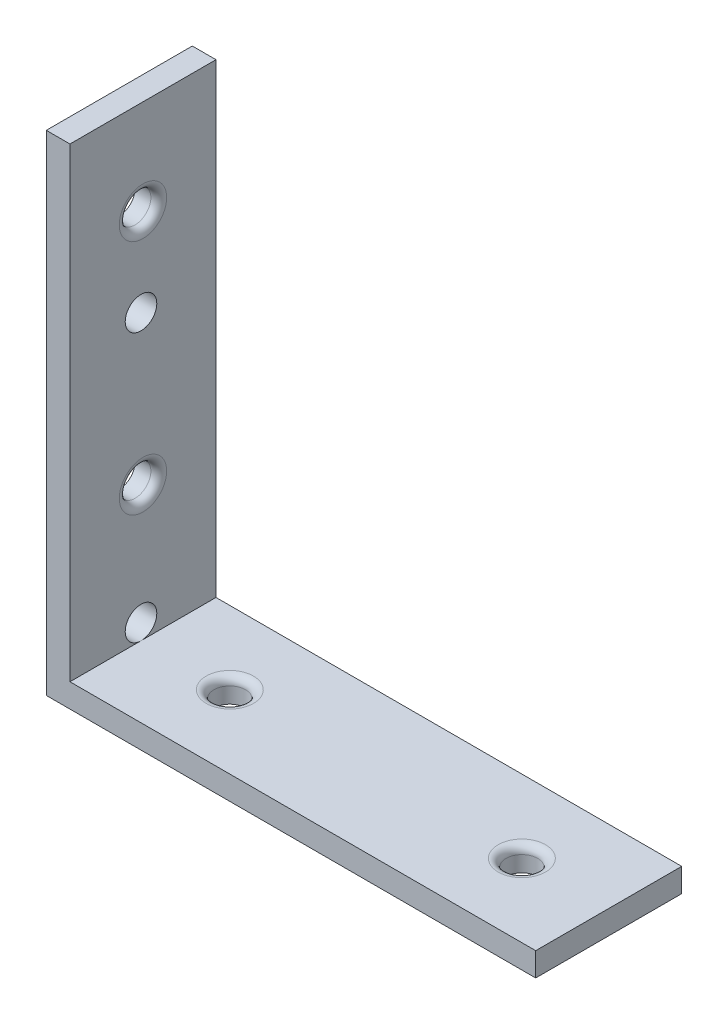
ISO-10303-21;
HEADER;
FILE_DESCRIPTION(('STEP AP214'),'2;1');
FILE_NAME('part.step','',(''),(''),'','','');
FILE_SCHEMA(('AUTOMOTIVE_DESIGN { 1 0 10303 214 1 1 1 1 }'));
ENDSEC;
DATA;
#1=APPLICATION_CONTEXT('core data for automotive mechanical design processes');
#2=APPLICATION_PROTOCOL_DEFINITION('international standard','automotive_design',2000,#1);
#3=PRODUCT_CONTEXT('',#1,'mechanical');
#4=PRODUCT('Part','Part','',(#3));
#5=PRODUCT_RELATED_PRODUCT_CATEGORY('part','',(#4));
#6=PRODUCT_DEFINITION_FORMATION('','',#4);
#7=PRODUCT_DEFINITION_CONTEXT('part definition',#1,'design');
#8=PRODUCT_DEFINITION('design','',#6,#7);
#9=PRODUCT_DEFINITION_SHAPE('','',#8);
#10=(LENGTH_UNIT() NAMED_UNIT(*) SI_UNIT(.MILLI.,.METRE.));
#11=(NAMED_UNIT(*) PLANE_ANGLE_UNIT() SI_UNIT($,.RADIAN.));
#12=(NAMED_UNIT(*) SI_UNIT($,.STERADIAN.) SOLID_ANGLE_UNIT());
#13=UNCERTAINTY_MEASURE_WITH_UNIT(LENGTH_MEASURE(1.E-05),#10,'distance_accuracy_value','');
#14=(GEOMETRIC_REPRESENTATION_CONTEXT(3) GLOBAL_UNCERTAINTY_ASSIGNED_CONTEXT((#13)) GLOBAL_UNIT_ASSIGNED_CONTEXT((#10,
#11,#12)) REPRESENTATION_CONTEXT('',''));
#15=CARTESIAN_POINT('',(0.,0.,0.));
#16=DIRECTION('',(0.,0.,1.));
#17=DIRECTION('',(1.,0.,0.));
#18=AXIS2_PLACEMENT_3D('',#15,#16,#17);
#19=CARTESIAN_POINT('',(31.,31.,18.5));
#20=DIRECTION('',(-1.,0.,0.));
#21=DIRECTION('',(0.,0.,1.));
#22=AXIS2_PLACEMENT_3D('',#19,#20,#21);
#23=PLANE('',#22);
#24=DIRECTION('',(0.,1.,0.));
#25=VECTOR('',#24,1.);
#26=CARTESIAN_POINT('',(31.,31.,0.));
#27=LINE('',#26,#25);
#28=CARTESIAN_POINT('',(31.,-31.,0.));
#29=VERTEX_POINT('',#28);
#30=CARTESIAN_POINT('',(31.,-28.,0.));
#31=VERTEX_POINT('',#30);
#32=EDGE_CURVE('E134',#29,#31,#27,.T.);
#33=ORIENTED_EDGE('',*,*,#32,.T.);
#34=DIRECTION('',(0.,0.,1.));
#35=VECTOR('',#34,1.);
#36=CARTESIAN_POINT('',(31.,-28.,0.));
#37=LINE('',#36,#35);
#38=CARTESIAN_POINT('',(31.,-28.,18.5));
#39=VERTEX_POINT('',#38);
#40=EDGE_CURVE('E141',#31,#39,#37,.T.);
#41=ORIENTED_EDGE('',*,*,#40,.T.);
#42=DIRECTION('',(0.,1.,0.));
#43=VECTOR('',#42,1.);
#44=CARTESIAN_POINT('',(31.,31.,18.5));
#45=LINE('',#44,#43);
#46=CARTESIAN_POINT('',(31.,-31.,18.5));
#47=VERTEX_POINT('',#46);
#48=EDGE_CURVE('E147',#47,#39,#45,.T.);
#49=ORIENTED_EDGE('',*,*,#48,.F.);
#50=DIRECTION('',(0.,0.,-1.));
#51=VECTOR('',#50,1.);
#52=CARTESIAN_POINT('',(31.,-31.,18.5));
#53=LINE('',#52,#51);
#54=EDGE_CURVE('E148',#47,#29,#53,.T.);
#55=ORIENTED_EDGE('',*,*,#54,.T.);
#56=EDGE_LOOP('',(#33,#41,#49,#55));
#57=FACE_BOUND('',#56,.T.);
#58=ADVANCED_FACE('F50',(#57),#23,.F.);
#59=CARTESIAN_POINT('',(-31.,31.,18.5));
#60=DIRECTION('',(0.,-1.,0.));
#61=DIRECTION('',(0.,0.,-1.));
#62=AXIS2_PLACEMENT_3D('',#59,#60,#61);
#63=PLANE('',#62);
#64=DIRECTION('',(-1.,0.,0.));
#65=VECTOR('',#64,1.);
#66=CARTESIAN_POINT('',(-31.,31.,18.5));
#67=LINE('',#66,#65);
#68=CARTESIAN_POINT('',(-28.,31.,18.5));
#69=VERTEX_POINT('',#68);
#70=CARTESIAN_POINT('',(-31.,31.,18.5));
#71=VERTEX_POINT('',#70);
#72=EDGE_CURVE('E125',#69,#71,#67,.T.);
#73=ORIENTED_EDGE('',*,*,#72,.F.);
#74=DIRECTION('',(0.,0.,1.));
#75=VECTOR('',#74,1.);
#76=CARTESIAN_POINT('',(-28.,31.,0.));
#77=LINE('',#76,#75);
#78=CARTESIAN_POINT('',(-28.,31.,0.));
#79=VERTEX_POINT('',#78);
#80=EDGE_CURVE('E111',#79,#69,#77,.T.);
#81=ORIENTED_EDGE('',*,*,#80,.F.);
#82=DIRECTION('',(-1.,0.,0.));
#83=VECTOR('',#82,1.);
#84=CARTESIAN_POINT('',(-31.,31.,0.));
#85=LINE('',#84,#83);
#86=CARTESIAN_POINT('',(-31.,31.,0.));
#87=VERTEX_POINT('',#86);
#88=EDGE_CURVE('E123',#79,#87,#85,.T.);
#89=ORIENTED_EDGE('',*,*,#88,.T.);
#90=DIRECTION('',(0.,0.,-1.));
#91=VECTOR('',#90,1.);
#92=CARTESIAN_POINT('',(-31.,31.,18.5));
#93=LINE('',#92,#91);
#94=EDGE_CURVE('E157',#71,#87,#93,.T.);
#95=ORIENTED_EDGE('',*,*,#94,.F.);
#96=EDGE_LOOP('',(#73,#81,#89,#95));
#97=FACE_BOUND('',#96,.T.);
#98=ADVANCED_FACE('F121',(#97),#63,.F.);
#99=CARTESIAN_POINT('',(-31.,31.,18.5));
#100=DIRECTION('',(1.,0.,0.));
#101=DIRECTION('',(0.,0.,-1.));
#102=AXIS2_PLACEMENT_3D('',#99,#100,#101);
#103=PLANE('',#102);
#104=CARTESIAN_POINT('',(-31.,8.,9.5));
#105=DIRECTION('',(1.,0.,0.));
#106=DIRECTION('',(0.,1.,0.));
#107=AXIS2_PLACEMENT_3D('',#104,#105,#106);
#108=CIRCLE('',#107,2.);
#109=CARTESIAN_POINT('',(-31.,10.,9.5));
#110=VERTEX_POINT('',#109);
#111=EDGE_CURVE('E282',#110,#110,#108,.T.);
#112=ORIENTED_EDGE('',*,*,#111,.T.);
#113=EDGE_LOOP('',(#112));
#114=FACE_BOUND('',#113,.T.);
#115=CARTESIAN_POINT('',(-31.,-26.,9.5));
#116=DIRECTION('',(1.,0.,0.));
#117=DIRECTION('',(0.,1.,0.));
#118=AXIS2_PLACEMENT_3D('',#115,#116,#117);
#119=CIRCLE('',#118,2.);
#120=CARTESIAN_POINT('',(-31.,-24.,9.5));
#121=VERTEX_POINT('',#120);
#122=EDGE_CURVE('E281',#121,#121,#119,.T.);
#123=ORIENTED_EDGE('',*,*,#122,.T.);
#124=EDGE_LOOP('',(#123));
#125=FACE_BOUND('',#124,.T.);
#126=CARTESIAN_POINT('',(-31.,19.,9.25));
#127=DIRECTION('',(1.,0.,0.));
#128=DIRECTION('',(0.,1.,0.));
#129=AXIS2_PLACEMENT_3D('',#126,#127,#128);
#130=CIRCLE('',#129,2.);
#131=CARTESIAN_POINT('',(-31.,21.,9.25));
#132=VERTEX_POINT('',#131);
#133=EDGE_CURVE('E287',#132,#132,#130,.T.);
#134=ORIENTED_EDGE('',*,*,#133,.T.);
#135=EDGE_LOOP('',(#134));
#136=FACE_BOUND('',#135,.T.);
#137=CARTESIAN_POINT('',(-31.,-11.,9.25));
#138=DIRECTION('',(1.,0.,0.));
#139=DIRECTION('',(0.,1.,0.));
#140=AXIS2_PLACEMENT_3D('',#137,#138,#139);
#141=CIRCLE('',#140,2.);
#142=CARTESIAN_POINT('',(-31.,-9.,9.25));
#143=VERTEX_POINT('',#142);
#144=EDGE_CURVE('E246',#143,#143,#141,.T.);
#145=ORIENTED_EDGE('',*,*,#144,.T.);
#146=EDGE_LOOP('',(#145));
#147=FACE_BOUND('',#146,.T.);
#148=DIRECTION('',(0.,-1.,0.));
#149=VECTOR('',#148,1.);
#150=CARTESIAN_POINT('',(-31.,31.,0.));
#151=LINE('',#150,#149);
#152=CARTESIAN_POINT('',(-31.,-31.,0.));
#153=VERTEX_POINT('',#152);
#154=EDGE_CURVE('E132',#87,#153,#151,.T.);
#155=ORIENTED_EDGE('',*,*,#154,.T.);
#156=DIRECTION('',(0.,0.,-1.));
#157=VECTOR('',#156,1.);
#158=CARTESIAN_POINT('',(-31.,-31.,18.5));
#159=LINE('',#158,#157);
#160=CARTESIAN_POINT('',(-31.,-31.,18.5));
#161=VERTEX_POINT('',#160);
#162=EDGE_CURVE('E152',#161,#153,#159,.T.);
#163=ORIENTED_EDGE('',*,*,#162,.F.);
#164=DIRECTION('',(0.,-1.,0.));
#165=VECTOR('',#164,1.);
#166=CARTESIAN_POINT('',(-31.,31.,18.5));
#167=LINE('',#166,#165);
#168=EDGE_CURVE('E264',#71,#161,#167,.T.);
#169=ORIENTED_EDGE('',*,*,#168,.F.);
#170=ORIENTED_EDGE('',*,*,#94,.T.);
#171=EDGE_LOOP('',(#155,#163,#169,#170));
#172=FACE_BOUND('',#171,.T.);
#173=ADVANCED_FACE('F210',(#114,#125,#136,#147,#172),#103,.F.);
#174=CARTESIAN_POINT('',(-31.,-31.,18.5));
#175=DIRECTION('',(0.,1.,0.));
#176=DIRECTION('',(0.,0.,1.));
#177=AXIS2_PLACEMENT_3D('',#174,#175,#176);
#178=PLANE('',#177);
#179=CARTESIAN_POINT('',(20.,-31.,9.25));
#180=DIRECTION('',(0.,1.,0.));
#181=DIRECTION('',(-1.,0.,0.));
#182=AXIS2_PLACEMENT_3D('',#179,#180,#181);
#183=CIRCLE('',#182,2.);
#184=CARTESIAN_POINT('',(18.,-31.,9.25));
#185=VERTEX_POINT('',#184);
#186=EDGE_CURVE('E240',#185,#185,#183,.T.);
#187=ORIENTED_EDGE('',*,*,#186,.T.);
#188=EDGE_LOOP('',(#187));
#189=FACE_BOUND('',#188,.T.);
#190=CARTESIAN_POINT('',(-17.,-31.,9.25));
#191=DIRECTION('',(0.,1.,0.));
#192=DIRECTION('',(-1.,0.,0.));
#193=AXIS2_PLACEMENT_3D('',#190,#191,#192);
#194=CIRCLE('',#193,2.);
#195=CARTESIAN_POINT('',(-19.,-31.,9.25));
#196=VERTEX_POINT('',#195);
#197=EDGE_CURVE('E236',#196,#196,#194,.T.);
#198=ORIENTED_EDGE('',*,*,#197,.T.);
#199=EDGE_LOOP('',(#198));
#200=FACE_BOUND('',#199,.T.);
#201=DIRECTION('',(1.,0.,0.));
#202=VECTOR('',#201,1.);
#203=CARTESIAN_POINT('',(-31.,-31.,0.));
#204=LINE('',#203,#202);
#205=EDGE_CURVE('E138',#153,#29,#204,.T.);
#206=ORIENTED_EDGE('',*,*,#205,.T.);
#207=ORIENTED_EDGE('',*,*,#54,.F.);
#208=DIRECTION('',(1.,0.,0.));
#209=VECTOR('',#208,1.);
#210=CARTESIAN_POINT('',(-31.,-31.,18.5));
#211=LINE('',#210,#209);
#212=EDGE_CURVE('E153',#161,#47,#211,.T.);
#213=ORIENTED_EDGE('',*,*,#212,.F.);
#214=ORIENTED_EDGE('',*,*,#162,.T.);
#215=EDGE_LOOP('',(#206,#207,#213,#214));
#216=FACE_BOUND('',#215,.T.);
#217=ADVANCED_FACE('F276',(#189,#200,#216),#178,.F.);
#218=CARTESIAN_POINT('',(0.,0.,18.5));
#219=DIRECTION('',(0.,0.,1.));
#220=DIRECTION('',(1.,0.,0.));
#221=AXIS2_PLACEMENT_3D('',#218,#219,#220);
#222=PLANE('',#221);
#223=DIRECTION('',(1.,0.,0.));
#224=VECTOR('',#223,1.);
#225=CARTESIAN_POINT('',(31.,-28.,18.5));
#226=LINE('',#225,#224);
#227=CARTESIAN_POINT('',(-28.,-28.,18.5));
#228=VERTEX_POINT('',#227);
#229=EDGE_CURVE('E117',#228,#39,#226,.T.);
#230=ORIENTED_EDGE('',*,*,#229,.F.);
#231=DIRECTION('',(0.,-1.,0.));
#232=VECTOR('',#231,1.);
#233=CARTESIAN_POINT('',(-28.,31.,18.5));
#234=LINE('',#233,#232);
#235=EDGE_CURVE('E239',#69,#228,#234,.T.);
#236=ORIENTED_EDGE('',*,*,#235,.F.);
#237=ORIENTED_EDGE('',*,*,#72,.T.);
#238=ORIENTED_EDGE('',*,*,#168,.T.);
#239=ORIENTED_EDGE('',*,*,#212,.T.);
#240=ORIENTED_EDGE('',*,*,#48,.T.);
#241=EDGE_LOOP('',(#230,#236,#237,#238,#239,#240));
#242=FACE_BOUND('',#241,.T.);
#243=ADVANCED_FACE('F271',(#242),#222,.T.);
#244=CARTESIAN_POINT('',(0.,0.,0.));
#245=DIRECTION('',(0.,0.,1.));
#246=DIRECTION('',(1.,0.,0.));
#247=AXIS2_PLACEMENT_3D('',#244,#245,#246);
#248=PLANE('',#247);
#249=DIRECTION('',(0.,-1.,0.));
#250=VECTOR('',#249,1.);
#251=CARTESIAN_POINT('',(-28.,31.,0.));
#252=LINE('',#251,#250);
#253=CARTESIAN_POINT('',(-28.,-28.,0.));
#254=VERTEX_POINT('',#253);
#255=EDGE_CURVE('E106',#79,#254,#252,.T.);
#256=ORIENTED_EDGE('',*,*,#255,.T.);
#257=DIRECTION('',(1.,0.,0.));
#258=VECTOR('',#257,1.);
#259=CARTESIAN_POINT('',(31.,-28.,0.));
#260=LINE('',#259,#258);
#261=EDGE_CURVE('E71',#254,#31,#260,.T.);
#262=ORIENTED_EDGE('',*,*,#261,.T.);
#263=ORIENTED_EDGE('',*,*,#32,.F.);
#264=ORIENTED_EDGE('',*,*,#205,.F.);
#265=ORIENTED_EDGE('',*,*,#154,.F.);
#266=ORIENTED_EDGE('',*,*,#88,.F.);
#267=EDGE_LOOP('',(#256,#262,#263,#264,#265,#266));
#268=FACE_BOUND('',#267,.T.);
#269=ADVANCED_FACE('F130',(#268),#248,.F.);
#270=CARTESIAN_POINT('',(31.,-28.,0.));
#271=DIRECTION('',(0.,-1.,0.));
#272=DIRECTION('',(1.,0.,0.));
#273=AXIS2_PLACEMENT_3D('',#270,#271,#272);
#274=PLANE('',#273);
#275=CARTESIAN_POINT('',(-17.,-28.,9.25));
#276=DIRECTION('',(0.,-1.,0.));
#277=DIRECTION('',(1.,0.,0.));
#278=AXIS2_PLACEMENT_3D('',#275,#276,#277);
#279=CIRCLE('',#278,3.);
#280=CARTESIAN_POINT('',(-14.,-28.,9.25));
#281=VERTEX_POINT('',#280);
#282=EDGE_CURVE('E172',#281,#281,#279,.T.);
#283=ORIENTED_EDGE('',*,*,#282,.T.);
#284=EDGE_LOOP('',(#283));
#285=FACE_BOUND('',#284,.T.);
#286=CARTESIAN_POINT('',(20.,-28.,9.25));
#287=DIRECTION('',(0.,-1.,0.));
#288=DIRECTION('',(1.,0.,0.));
#289=AXIS2_PLACEMENT_3D('',#286,#287,#288);
#290=CIRCLE('',#289,3.);
#291=CARTESIAN_POINT('',(23.,-28.,9.25));
#292=VERTEX_POINT('',#291);
#293=EDGE_CURVE('E164',#292,#292,#290,.T.);
#294=ORIENTED_EDGE('',*,*,#293,.T.);
#295=EDGE_LOOP('',(#294));
#296=FACE_BOUND('',#295,.T.);
#297=ORIENTED_EDGE('',*,*,#229,.T.);
#298=ORIENTED_EDGE('',*,*,#40,.F.);
#299=ORIENTED_EDGE('',*,*,#261,.F.);
#300=DIRECTION('',(0.,0.,1.));
#301=VECTOR('',#300,1.);
#302=CARTESIAN_POINT('',(-28.,-28.,0.));
#303=LINE('',#302,#301);
#304=CARTESIAN_POINT('',(-28.,-28.,9.5));
#305=VERTEX_POINT('',#304);
#306=EDGE_CURVE('E113',#254,#305,#303,.T.);
#307=ORIENTED_EDGE('',*,*,#306,.T.);
#308=EDGE_CURVE('E127',#305,#228,#303,.T.);
#309=ORIENTED_EDGE('',*,*,#308,.T.);
#310=EDGE_LOOP('',(#297,#298,#299,#307,#309));
#311=FACE_BOUND('',#310,.T.);
#312=ADVANCED_FACE('F278',(#285,#296,#311),#274,.F.);
#313=CARTESIAN_POINT('',(-28.,31.,0.));
#314=DIRECTION('',(-1.,0.,0.));
#315=DIRECTION('',(0.,-1.,0.));
#316=AXIS2_PLACEMENT_3D('',#313,#314,#315);
#317=PLANE('',#316);
#318=CARTESIAN_POINT('',(-28.,8.,9.5));
#319=DIRECTION('',(1.,0.,0.));
#320=DIRECTION('',(0.,1.,0.));
#321=AXIS2_PLACEMENT_3D('',#318,#319,#320);
#322=CIRCLE('',#321,2.);
#323=CARTESIAN_POINT('',(-28.,10.,9.5));
#324=VERTEX_POINT('',#323);
#325=EDGE_CURVE('E290',#324,#324,#322,.T.);
#326=ORIENTED_EDGE('',*,*,#325,.F.);
#327=EDGE_LOOP('',(#326));
#328=FACE_BOUND('',#327,.T.);
#329=CARTESIAN_POINT('',(-28.,-11.,9.25));
#330=DIRECTION('',(-1.,0.,0.));
#331=DIRECTION('',(0.,-1.,0.));
#332=AXIS2_PLACEMENT_3D('',#329,#330,#331);
#333=CIRCLE('',#332,3.);
#334=CARTESIAN_POINT('',(-28.,-14.,9.25));
#335=VERTEX_POINT('',#334);
#336=EDGE_CURVE('E13',#335,#335,#333,.T.);
#337=ORIENTED_EDGE('',*,*,#336,.T.);
#338=EDGE_LOOP('',(#337));
#339=FACE_BOUND('',#338,.T.);
#340=CARTESIAN_POINT('',(-28.,19.,9.25));
#341=DIRECTION('',(-1.,0.,0.));
#342=DIRECTION('',(0.,-1.,0.));
#343=AXIS2_PLACEMENT_3D('',#340,#341,#342);
#344=CIRCLE('',#343,3.);
#345=CARTESIAN_POINT('',(-28.,16.,9.25));
#346=VERTEX_POINT('',#345);
#347=EDGE_CURVE('E180',#346,#346,#344,.T.);
#348=ORIENTED_EDGE('',*,*,#347,.T.);
#349=EDGE_LOOP('',(#348));
#350=FACE_BOUND('',#349,.T.);
#351=ORIENTED_EDGE('',*,*,#308,.F.);
#352=CARTESIAN_POINT('',(-28.,-26.,9.5));
#353=DIRECTION('',(1.,0.,0.));
#354=DIRECTION('',(0.,1.,0.));
#355=AXIS2_PLACEMENT_3D('',#352,#353,#354);
#356=CIRCLE('',#355,2.);
#357=EDGE_CURVE('E64',#305,#305,#356,.T.);
#358=ORIENTED_EDGE('',*,*,#357,.F.);
#359=ORIENTED_EDGE('',*,*,#306,.F.);
#360=ORIENTED_EDGE('',*,*,#255,.F.);
#361=ORIENTED_EDGE('',*,*,#80,.T.);
#362=ORIENTED_EDGE('',*,*,#235,.T.);
#363=EDGE_LOOP('',(#351,#358,#359,#360,#361,#362));
#364=FACE_BOUND('',#363,.T.);
#365=ADVANCED_FACE('F109',(#328,#339,#350,#364),#317,.F.);
#366=CARTESIAN_POINT('',(-17.,-31.,9.25));
#367=DIRECTION('',(0.,1.,0.));
#368=DIRECTION('',(-1.,0.,0.));
#369=AXIS2_PLACEMENT_3D('',#366,#367,#368);
#370=CYLINDRICAL_SURFACE('',#369,2.);
#371=CARTESIAN_POINT('',(-17.,-29.,9.25));
#372=DIRECTION('',(0.,-1.,0.));
#373=DIRECTION('',(1.,0.,0.));
#374=AXIS2_PLACEMENT_3D('',#371,#372,#373);
#375=CIRCLE('',#374,2.);
#376=CARTESIAN_POINT('',(-15.,-29.,9.25));
#377=VERTEX_POINT('',#376);
#378=EDGE_CURVE('E168',#377,#377,#375,.F.);
#379=ORIENTED_EDGE('',*,*,#378,.T.);
#380=EDGE_LOOP('',(#379));
#381=FACE_BOUND('',#380,.T.);
#382=ORIENTED_EDGE('',*,*,#197,.F.);
#383=EDGE_LOOP('',(#382));
#384=FACE_BOUND('',#383,.T.);
#385=ADVANCED_FACE('F230',(#381,#384),#370,.F.);
#386=CARTESIAN_POINT('',(20.,-31.,9.25));
#387=DIRECTION('',(0.,1.,0.));
#388=DIRECTION('',(-1.,0.,0.));
#389=AXIS2_PLACEMENT_3D('',#386,#387,#388);
#390=CYLINDRICAL_SURFACE('',#389,2.);
#391=CARTESIAN_POINT('',(20.,-29.,9.25));
#392=DIRECTION('',(0.,-1.,0.));
#393=DIRECTION('',(1.,0.,0.));
#394=AXIS2_PLACEMENT_3D('',#391,#392,#393);
#395=CIRCLE('',#394,2.);
#396=CARTESIAN_POINT('',(22.,-29.,9.25));
#397=VERTEX_POINT('',#396);
#398=EDGE_CURVE('E160',#397,#397,#395,.F.);
#399=ORIENTED_EDGE('',*,*,#398,.T.);
#400=EDGE_LOOP('',(#399));
#401=FACE_BOUND('',#400,.T.);
#402=ORIENTED_EDGE('',*,*,#186,.F.);
#403=EDGE_LOOP('',(#402));
#404=FACE_BOUND('',#403,.T.);
#405=ADVANCED_FACE('F218',(#401,#404),#390,.F.);
#406=CARTESIAN_POINT('',(20.,-29.,9.25));
#407=DIRECTION('',(0.,-1.,0.));
#408=DIRECTION('',(1.,0.,0.));
#409=AXIS2_PLACEMENT_3D('',#406,#407,#408);
#410=TOROIDAL_SURFACE('',#409,3.,1.);
#411=ORIENTED_EDGE('',*,*,#293,.F.);
#412=EDGE_LOOP('',(#411));
#413=FACE_BOUND('',#412,.T.);
#414=ORIENTED_EDGE('',*,*,#398,.F.);
#415=EDGE_LOOP('',(#414));
#416=FACE_BOUND('',#415,.T.);
#417=ADVANCED_FACE('F214',(#413,#416),#410,.T.);
#418=CARTESIAN_POINT('',(-17.,-29.,9.25));
#419=DIRECTION('',(0.,-1.,0.));
#420=DIRECTION('',(1.,0.,0.));
#421=AXIS2_PLACEMENT_3D('',#418,#419,#420);
#422=TOROIDAL_SURFACE('',#421,3.,1.);
#423=ORIENTED_EDGE('',*,*,#282,.F.);
#424=EDGE_LOOP('',(#423));
#425=FACE_BOUND('',#424,.T.);
#426=ORIENTED_EDGE('',*,*,#378,.F.);
#427=EDGE_LOOP('',(#426));
#428=FACE_BOUND('',#427,.T.);
#429=ADVANCED_FACE('F217',(#425,#428),#422,.T.);
#430=CARTESIAN_POINT('',(-31.,-11.,9.25));
#431=DIRECTION('',(1.,0.,0.));
#432=DIRECTION('',(0.,1.,0.));
#433=AXIS2_PLACEMENT_3D('',#430,#431,#432);
#434=CYLINDRICAL_SURFACE('',#433,2.);
#435=CARTESIAN_POINT('',(-29.,-11.,9.25));
#436=DIRECTION('',(-1.,0.,0.));
#437=DIRECTION('',(0.,-1.,0.));
#438=AXIS2_PLACEMENT_3D('',#435,#436,#437);
#439=CIRCLE('',#438,2.);
#440=CARTESIAN_POINT('',(-29.,-13.,9.25));
#441=VERTEX_POINT('',#440);
#442=EDGE_CURVE('E59',#441,#441,#439,.F.);
#443=ORIENTED_EDGE('',*,*,#442,.T.);
#444=EDGE_LOOP('',(#443));
#445=FACE_BOUND('',#444,.T.);
#446=ORIENTED_EDGE('',*,*,#144,.F.);
#447=EDGE_LOOP('',(#446));
#448=FACE_BOUND('',#447,.T.);
#449=ADVANCED_FACE('F187',(#445,#448),#434,.F.);
#450=CARTESIAN_POINT('',(-31.,19.,9.25));
#451=DIRECTION('',(1.,0.,0.));
#452=DIRECTION('',(0.,1.,0.));
#453=AXIS2_PLACEMENT_3D('',#450,#451,#452);
#454=CYLINDRICAL_SURFACE('',#453,2.);
#455=CARTESIAN_POINT('',(-29.,19.,9.25));
#456=DIRECTION('',(-1.,0.,0.));
#457=DIRECTION('',(0.,-1.,0.));
#458=AXIS2_PLACEMENT_3D('',#455,#456,#457);
#459=CIRCLE('',#458,2.);
#460=CARTESIAN_POINT('',(-29.,17.,9.25));
#461=VERTEX_POINT('',#460);
#462=EDGE_CURVE('E176',#461,#461,#459,.F.);
#463=ORIENTED_EDGE('',*,*,#462,.T.);
#464=EDGE_LOOP('',(#463));
#465=FACE_BOUND('',#464,.T.);
#466=ORIENTED_EDGE('',*,*,#133,.F.);
#467=EDGE_LOOP('',(#466));
#468=FACE_BOUND('',#467,.T.);
#469=ADVANCED_FACE('F201',(#465,#468),#454,.F.);
#470=CARTESIAN_POINT('',(-29.,19.,9.25));
#471=DIRECTION('',(-1.,0.,0.));
#472=DIRECTION('',(0.,-1.,0.));
#473=AXIS2_PLACEMENT_3D('',#470,#471,#472);
#474=TOROIDAL_SURFACE('',#473,3.,1.);
#475=ORIENTED_EDGE('',*,*,#347,.F.);
#476=EDGE_LOOP('',(#475));
#477=FACE_BOUND('',#476,.T.);
#478=ORIENTED_EDGE('',*,*,#462,.F.);
#479=EDGE_LOOP('',(#478));
#480=FACE_BOUND('',#479,.T.);
#481=ADVANCED_FACE('F192',(#477,#480),#474,.T.);
#482=CARTESIAN_POINT('',(-29.,-11.,9.25));
#483=DIRECTION('',(-1.,0.,0.));
#484=DIRECTION('',(0.,-1.,0.));
#485=AXIS2_PLACEMENT_3D('',#482,#483,#484);
#486=TOROIDAL_SURFACE('',#485,3.,1.);
#487=ORIENTED_EDGE('',*,*,#336,.F.);
#488=EDGE_LOOP('',(#487));
#489=FACE_BOUND('',#488,.T.);
#490=ORIENTED_EDGE('',*,*,#442,.F.);
#491=EDGE_LOOP('',(#490));
#492=FACE_BOUND('',#491,.T.);
#493=ADVANCED_FACE('F52',(#489,#492),#486,.T.);
#494=CARTESIAN_POINT('',(-31.,-26.,9.5));
#495=DIRECTION('',(1.,0.,0.));
#496=DIRECTION('',(0.,1.,0.));
#497=AXIS2_PLACEMENT_3D('',#494,#495,#496);
#498=CYLINDRICAL_SURFACE('',#497,2.);
#499=ORIENTED_EDGE('',*,*,#122,.F.);
#500=EDGE_LOOP('',(#499));
#501=FACE_BOUND('',#500,.T.);
#502=ORIENTED_EDGE('',*,*,#357,.T.);
#503=EDGE_LOOP('',(#502));
#504=FACE_BOUND('',#503,.T.);
#505=ADVANCED_FACE('F191',(#501,#504),#498,.F.);
#506=CARTESIAN_POINT('',(-31.,8.,9.5));
#507=DIRECTION('',(1.,0.,0.));
#508=DIRECTION('',(0.,1.,0.));
#509=AXIS2_PLACEMENT_3D('',#506,#507,#508);
#510=CYLINDRICAL_SURFACE('',#509,2.);
#511=ORIENTED_EDGE('',*,*,#111,.F.);
#512=EDGE_LOOP('',(#511));
#513=FACE_BOUND('',#512,.T.);
#514=ORIENTED_EDGE('',*,*,#325,.T.);
#515=EDGE_LOOP('',(#514));
#516=FACE_BOUND('',#515,.T.);
#517=ADVANCED_FACE('F198',(#513,#516),#510,.F.);
#518=CLOSED_SHELL('',(#58,#98,#173,#217,#243,#269,#312,#365,#385,#405,#417,#429,#449,#469,#481,
#493,#505,#517));
#519=MANIFOLD_SOLID_BREP('B2',#518);
#520=ADVANCED_BREP_SHAPE_REPRESENTATION('',(#18,#519),#14);
#521=SHAPE_DEFINITION_REPRESENTATION(#9,#520);
ENDSEC;
END-ISO-10303-21;
